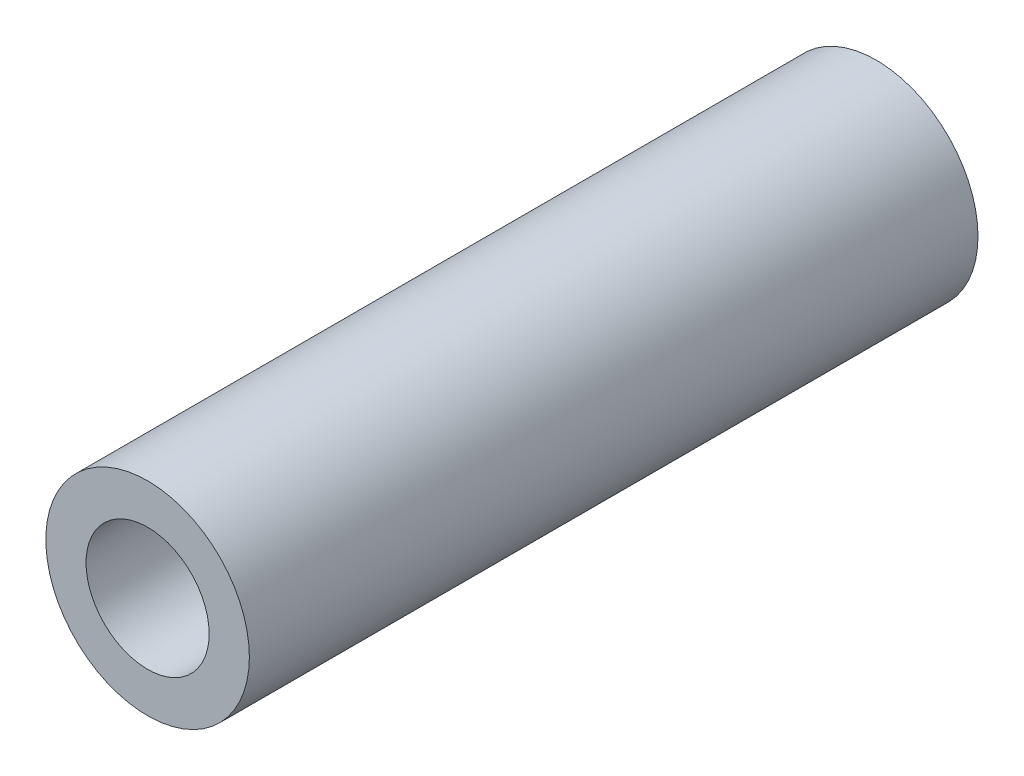
ISO-10303-21;
HEADER;
FILE_DESCRIPTION(('STEP AP214'),'2;1');
FILE_NAME('part.step','',(''),(''),'','','');
FILE_SCHEMA(('AUTOMOTIVE_DESIGN { 1 0 10303 214 1 1 1 1 }'));
ENDSEC;
DATA;
#1=APPLICATION_CONTEXT('core data for automotive mechanical design processes');
#2=APPLICATION_PROTOCOL_DEFINITION('international standard','automotive_design',2000,#1);
#3=PRODUCT_CONTEXT('',#1,'mechanical');
#4=PRODUCT('Part','Part','',(#3));
#5=PRODUCT_RELATED_PRODUCT_CATEGORY('part','',(#4));
#6=PRODUCT_DEFINITION_FORMATION('','',#4);
#7=PRODUCT_DEFINITION_CONTEXT('part definition',#1,'design');
#8=PRODUCT_DEFINITION('design','',#6,#7);
#9=PRODUCT_DEFINITION_SHAPE('','',#8);
#10=(LENGTH_UNIT() NAMED_UNIT(*) SI_UNIT(.MILLI.,.METRE.));
#11=(NAMED_UNIT(*) PLANE_ANGLE_UNIT() SI_UNIT($,.RADIAN.));
#12=(NAMED_UNIT(*) SI_UNIT($,.STERADIAN.) SOLID_ANGLE_UNIT());
#13=UNCERTAINTY_MEASURE_WITH_UNIT(LENGTH_MEASURE(1.E-05),#10,'distance_accuracy_value','');
#14=(GEOMETRIC_REPRESENTATION_CONTEXT(3) GLOBAL_UNCERTAINTY_ASSIGNED_CONTEXT((#13)) GLOBAL_UNIT_ASSIGNED_CONTEXT((#10,
#11,#12)) REPRESENTATION_CONTEXT('',''));
#15=CARTESIAN_POINT('',(0.,0.,0.));
#16=DIRECTION('',(0.,0.,1.));
#17=DIRECTION('',(1.,0.,0.));
#18=AXIS2_PLACEMENT_3D('',#15,#16,#17);
#19=CARTESIAN_POINT('',(0.,0.,29.));
#20=DIRECTION('',(0.,0.,1.));
#21=DIRECTION('',(1.,0.,0.));
#22=AXIS2_PLACEMENT_3D('',#19,#20,#21);
#23=PLANE('',#22);
#24=CARTESIAN_POINT('',(0.,0.,29.));
#25=DIRECTION('',(0.,0.,1.));
#26=DIRECTION('',(1.,0.,0.));
#27=AXIS2_PLACEMENT_3D('',#24,#25,#26);
#28=CIRCLE('',#27,4.05);
#29=CARTESIAN_POINT('',(4.05,0.,29.));
#30=VERTEX_POINT('',#29);
#31=EDGE_CURVE('E10',#30,#30,#28,.T.);
#32=ORIENTED_EDGE('',*,*,#31,.T.);
#33=EDGE_LOOP('',(#32));
#34=FACE_BOUND('',#33,.T.);
#35=CARTESIAN_POINT('',(0.,0.,29.));
#36=DIRECTION('',(0.,0.,1.));
#37=DIRECTION('',(1.,0.,0.));
#38=AXIS2_PLACEMENT_3D('',#35,#36,#37);
#39=CIRCLE('',#38,2.45);
#40=CARTESIAN_POINT('',(2.45,0.,29.));
#41=VERTEX_POINT('',#40);
#42=EDGE_CURVE('E42',#41,#41,#39,.T.);
#43=ORIENTED_EDGE('',*,*,#42,.F.);
#44=EDGE_LOOP('',(#43));
#45=FACE_BOUND('',#44,.T.);
#46=ADVANCED_FACE('F31',(#34,#45),#23,.T.);
#47=CARTESIAN_POINT('',(0.,0.,0.));
#48=DIRECTION('',(0.,0.,1.));
#49=DIRECTION('',(1.,0.,0.));
#50=AXIS2_PLACEMENT_3D('',#47,#48,#49);
#51=PLANE('',#50);
#52=CARTESIAN_POINT('',(0.,0.,0.));
#53=DIRECTION('',(0.,0.,1.));
#54=DIRECTION('',(1.,0.,0.));
#55=AXIS2_PLACEMENT_3D('',#52,#53,#54);
#56=CIRCLE('',#55,4.05);
#57=CARTESIAN_POINT('',(4.05,0.,0.));
#58=VERTEX_POINT('',#57);
#59=EDGE_CURVE('E35',#58,#58,#56,.T.);
#60=ORIENTED_EDGE('',*,*,#59,.F.);
#61=EDGE_LOOP('',(#60));
#62=FACE_BOUND('',#61,.T.);
#63=CARTESIAN_POINT('',(0.,0.,0.));
#64=DIRECTION('',(0.,0.,1.));
#65=DIRECTION('',(1.,0.,0.));
#66=AXIS2_PLACEMENT_3D('',#63,#64,#65);
#67=CIRCLE('',#66,2.45);
#68=CARTESIAN_POINT('',(2.45,0.,0.));
#69=VERTEX_POINT('',#68);
#70=EDGE_CURVE('E44',#69,#69,#67,.T.);
#71=ORIENTED_EDGE('',*,*,#70,.T.);
#72=EDGE_LOOP('',(#71));
#73=FACE_BOUND('',#72,.T.);
#74=ADVANCED_FACE('F54',(#62,#73),#51,.F.);
#75=CARTESIAN_POINT('',(0.,0.,29.));
#76=DIRECTION('',(0.,0.,-1.));
#77=DIRECTION('',(-1.,0.,0.));
#78=AXIS2_PLACEMENT_3D('',#75,#76,#77);
#79=CYLINDRICAL_SURFACE('',#78,4.05);
#80=ORIENTED_EDGE('',*,*,#31,.F.);
#81=EDGE_LOOP('',(#80));
#82=FACE_BOUND('',#81,.T.);
#83=ORIENTED_EDGE('',*,*,#59,.T.);
#84=EDGE_LOOP('',(#83));
#85=FACE_BOUND('',#84,.T.);
#86=ADVANCED_FACE('F33',(#82,#85),#79,.T.);
#87=CARTESIAN_POINT('',(0.,0.,29.));
#88=DIRECTION('',(0.,0.,-1.));
#89=DIRECTION('',(-1.,0.,0.));
#90=AXIS2_PLACEMENT_3D('',#87,#88,#89);
#91=CYLINDRICAL_SURFACE('',#90,2.45);
#92=ORIENTED_EDGE('',*,*,#42,.T.);
#93=EDGE_LOOP('',(#92));
#94=FACE_BOUND('',#93,.T.);
#95=ORIENTED_EDGE('',*,*,#70,.F.);
#96=EDGE_LOOP('',(#95));
#97=FACE_BOUND('',#96,.T.);
#98=ADVANCED_FACE('F50',(#94,#97),#91,.F.);
#99=CLOSED_SHELL('',(#46,#74,#86,#98));
#100=MANIFOLD_SOLID_BREP('B2',#99);
#101=ADVANCED_BREP_SHAPE_REPRESENTATION('',(#18,#100),#14);
#102=SHAPE_DEFINITION_REPRESENTATION(#9,#101);
ENDSEC;
END-ISO-10303-21;
